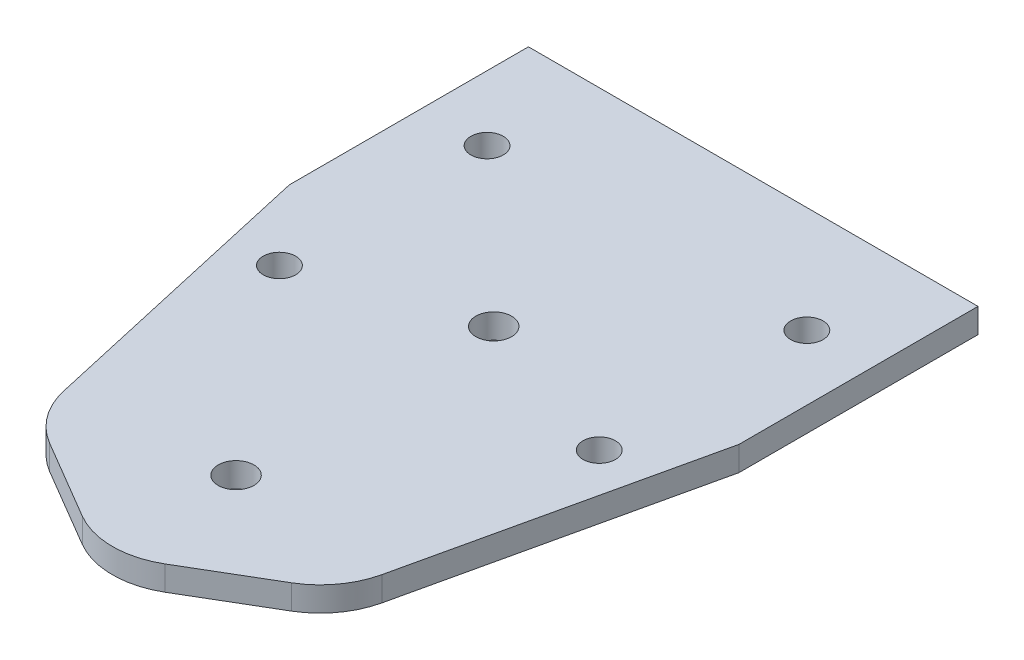
ISO-10303-21;
HEADER;
FILE_DESCRIPTION(('STEP AP214'),'2;1');
FILE_NAME('part.step','',(''),(''),'','','');
FILE_SCHEMA(('AUTOMOTIVE_DESIGN { 1 0 10303 214 1 1 1 1 }'));
ENDSEC;
DATA;
#1=APPLICATION_CONTEXT('core data for automotive mechanical design processes');
#2=APPLICATION_PROTOCOL_DEFINITION('international standard','automotive_design',2000,#1);
#3=PRODUCT_CONTEXT('',#1,'mechanical');
#4=PRODUCT('Part','Part','',(#3));
#5=PRODUCT_RELATED_PRODUCT_CATEGORY('part','',(#4));
#6=PRODUCT_DEFINITION_FORMATION('','',#4);
#7=PRODUCT_DEFINITION_CONTEXT('part definition',#1,'design');
#8=PRODUCT_DEFINITION('design','',#6,#7);
#9=PRODUCT_DEFINITION_SHAPE('','',#8);
#10=(LENGTH_UNIT() NAMED_UNIT(*) SI_UNIT(.MILLI.,.METRE.));
#11=(NAMED_UNIT(*) PLANE_ANGLE_UNIT() SI_UNIT($,.RADIAN.));
#12=(NAMED_UNIT(*) SI_UNIT($,.STERADIAN.) SOLID_ANGLE_UNIT());
#13=UNCERTAINTY_MEASURE_WITH_UNIT(LENGTH_MEASURE(1.E-05),#10,'distance_accuracy_value','');
#14=(GEOMETRIC_REPRESENTATION_CONTEXT(3) GLOBAL_UNCERTAINTY_ASSIGNED_CONTEXT((#13)) GLOBAL_UNIT_ASSIGNED_CONTEXT((#10,
#11,#12)) REPRESENTATION_CONTEXT('',''));
#15=CARTESIAN_POINT('',(0.,0.,0.));
#16=DIRECTION('',(0.,0.,1.));
#17=DIRECTION('',(1.,0.,0.));
#18=AXIS2_PLACEMENT_3D('',#15,#16,#17);
#19=CARTESIAN_POINT('',(-27.5,3.,40.));
#20=DIRECTION('',(1.,0.,0.));
#21=DIRECTION('',(0.,0.,-1.));
#22=AXIS2_PLACEMENT_3D('',#19,#20,#21);
#23=PLANE('',#22);
#24=DIRECTION('',(0.,1.,0.));
#25=VECTOR('',#24,1.);
#26=CARTESIAN_POINT('',(-27.5,0.,-10.7528728164823));
#27=LINE('',#26,#25);
#28=CARTESIAN_POINT('',(-27.5,0.,-10.7528728164823));
#29=VERTEX_POINT('',#28);
#30=CARTESIAN_POINT('',(-27.5,3.,-10.7528728164823));
#31=VERTEX_POINT('',#30);
#32=EDGE_CURVE('E111',#29,#31,#27,.T.);
#33=ORIENTED_EDGE('',*,*,#32,.T.);
#34=DIRECTION('',(0.,0.,1.));
#35=VECTOR('',#34,1.);
#36=CARTESIAN_POINT('',(-27.5,3.,40.));
#37=LINE('',#36,#35);
#38=CARTESIAN_POINT('',(-27.5,3.,-40.));
#39=VERTEX_POINT('',#38);
#40=EDGE_CURVE('E145',#39,#31,#37,.T.);
#41=ORIENTED_EDGE('',*,*,#40,.F.);
#42=DIRECTION('',(0.,-1.,0.));
#43=VECTOR('',#42,1.);
#44=CARTESIAN_POINT('',(-27.5,3.,-40.));
#45=LINE('',#44,#43);
#46=CARTESIAN_POINT('',(-27.5,0.,-40.));
#47=VERTEX_POINT('',#46);
#48=EDGE_CURVE('E133',#39,#47,#45,.T.);
#49=ORIENTED_EDGE('',*,*,#48,.T.);
#50=DIRECTION('',(0.,0.,1.));
#51=VECTOR('',#50,1.);
#52=CARTESIAN_POINT('',(-27.5,0.,40.));
#53=LINE('',#52,#51);
#54=EDGE_CURVE('E128',#47,#29,#53,.T.);
#55=ORIENTED_EDGE('',*,*,#54,.T.);
#56=EDGE_LOOP('',(#33,#41,#49,#55));
#57=FACE_BOUND('',#56,.T.);
#58=ADVANCED_FACE('F33',(#57),#23,.F.);
#59=CARTESIAN_POINT('',(0.,3.,0.));
#60=DIRECTION('',(0.,-1.,0.));
#61=DIRECTION('',(0.,0.,-1.));
#62=AXIS2_PLACEMENT_3D('',#59,#60,#61);
#63=PLANE('',#62);
#64=CARTESIAN_POINT('',(0.,3.,-8.24999999999999));
#65=DIRECTION('',(0.,1.,0.));
#66=DIRECTION('',(0.,0.,1.));
#67=AXIS2_PLACEMENT_3D('',#64,#65,#66);
#68=CIRCLE('',#67,2.185);
#69=CARTESIAN_POINT('',(0.,3.,-6.065));
#70=VERTEX_POINT('',#69);
#71=EDGE_CURVE('E220',#70,#70,#68,.T.);
#72=ORIENTED_EDGE('',*,*,#71,.F.);
#73=EDGE_LOOP('',(#72));
#74=FACE_BOUND('',#73,.T.);
#75=CARTESIAN_POINT('',(0.,3.,23.271));
#76=DIRECTION('',(0.,1.,0.));
#77=DIRECTION('',(0.,0.,1.));
#78=AXIS2_PLACEMENT_3D('',#75,#76,#77);
#79=CIRCLE('',#78,2.185);
#80=CARTESIAN_POINT('',(0.,3.,25.456));
#81=VERTEX_POINT('',#80);
#82=EDGE_CURVE('E214',#81,#81,#79,.T.);
#83=ORIENTED_EDGE('',*,*,#82,.F.);
#84=EDGE_LOOP('',(#83));
#85=FACE_BOUND('',#84,.T.);
#86=CARTESIAN_POINT('',(-19.5625,3.,-27.));
#87=DIRECTION('',(0.,1.,0.));
#88=DIRECTION('',(0.,0.,1.));
#89=AXIS2_PLACEMENT_3D('',#86,#87,#88);
#90=CIRCLE('',#89,1.98437499999999);
#91=CARTESIAN_POINT('',(-19.5625,3.,-25.015625));
#92=VERTEX_POINT('',#91);
#93=EDGE_CURVE('E208',#92,#92,#90,.T.);
#94=ORIENTED_EDGE('',*,*,#93,.F.);
#95=EDGE_LOOP('',(#94));
#96=FACE_BOUND('',#95,.T.);
#97=CARTESIAN_POINT('',(-19.5625,3.,-1.59999999999999));
#98=DIRECTION('',(0.,1.,0.));
#99=DIRECTION('',(0.,0.,1.));
#100=AXIS2_PLACEMENT_3D('',#97,#98,#99);
#101=CIRCLE('',#100,1.984375);
#102=CARTESIAN_POINT('',(-19.5625,3.,0.384375000000001));
#103=VERTEX_POINT('',#102);
#104=EDGE_CURVE('E202',#103,#103,#101,.T.);
#105=ORIENTED_EDGE('',*,*,#104,.F.);
#106=EDGE_LOOP('',(#105));
#107=FACE_BOUND('',#106,.T.);
#108=CARTESIAN_POINT('',(19.5625,3.,-27.));
#109=DIRECTION('',(0.,1.,0.));
#110=DIRECTION('',(0.,0.,-1.));
#111=AXIS2_PLACEMENT_3D('',#108,#109,#110);
#112=CIRCLE('',#111,1.98437499999999);
#113=CARTESIAN_POINT('',(19.5625,3.,-28.984375));
#114=VERTEX_POINT('',#113);
#115=EDGE_CURVE('E196',#114,#114,#112,.T.);
#116=ORIENTED_EDGE('',*,*,#115,.F.);
#117=EDGE_LOOP('',(#116));
#118=FACE_BOUND('',#117,.T.);
#119=CARTESIAN_POINT('',(19.5625,3.,-1.6));
#120=DIRECTION('',(0.,1.,0.));
#121=DIRECTION('',(0.,0.,-1.));
#122=AXIS2_PLACEMENT_3D('',#119,#120,#121);
#123=CIRCLE('',#122,1.984375);
#124=CARTESIAN_POINT('',(19.5625,3.,-3.58437499999999));
#125=VERTEX_POINT('',#124);
#126=EDGE_CURVE('E192',#125,#125,#123,.T.);
#127=ORIENTED_EDGE('',*,*,#126,.F.);
#128=EDGE_LOOP('',(#127));
#129=FACE_BOUND('',#128,.T.);
#130=DIRECTION('',(-0.861586438812453,0.,0.507610882915719));
#131=VECTOR('',#130,1.);
#132=CARTESIAN_POINT('',(17.494026116552,3.,29.693247661821));
#133=LINE('',#132,#131);
#134=CARTESIAN_POINT('',(14.7835063829739,3.,31.2901731160081));
#135=VERTEX_POINT('',#134);
#136=CARTESIAN_POINT('',(5.07610882915718,3.,37.0093678724838));
#137=VERTEX_POINT('',#136);
#138=EDGE_CURVE('E185',#135,#137,#133,.T.);
#139=ORIENTED_EDGE('',*,*,#138,.F.);
#140=CARTESIAN_POINT('',(9.7073975538167,3.,22.6743087278836));
#141=DIRECTION('',(0.,-1.,0.));
#142=DIRECTION('',(0.,0.,-1.));
#143=AXIS2_PLACEMENT_3D('',#140,#141,#142);
#144=CIRCLE('',#143,10.);
#145=CARTESIAN_POINT('',(19.4622335199498,3.,24.875030262707));
#146=VERTEX_POINT('',#145);
#147=EDGE_CURVE('E157',#135,#146,#144,.F.);
#148=ORIENTED_EDGE('',*,*,#147,.T.);
#149=DIRECTION('',(-0.22007215348234,0.,0.975483596613314));
#150=VECTOR('',#149,1.);
#151=CARTESIAN_POINT('',(23.8597347329364,3.,5.38283085684337));
#152=LINE('',#151,#150);
#153=CARTESIAN_POINT('',(27.5,3.,-10.7528728164823));
#154=VERTEX_POINT('',#153);
#155=EDGE_CURVE('E121',#154,#146,#152,.T.);
#156=ORIENTED_EDGE('',*,*,#155,.F.);
#157=DIRECTION('',(0.,0.,-1.));
#158=VECTOR('',#157,1.);
#159=CARTESIAN_POINT('',(27.5,3.,40.));
#160=LINE('',#159,#158);
#161=CARTESIAN_POINT('',(27.5,3.,-40.));
#162=VERTEX_POINT('',#161);
#163=EDGE_CURVE('E134',#154,#162,#160,.T.);
#164=ORIENTED_EDGE('',*,*,#163,.T.);
#165=DIRECTION('',(-1.,0.,0.));
#166=VECTOR('',#165,1.);
#167=CARTESIAN_POINT('',(-27.5,3.,-40.));
#168=LINE('',#167,#166);
#169=EDGE_CURVE('E137',#162,#39,#168,.T.);
#170=ORIENTED_EDGE('',*,*,#169,.T.);
#171=ORIENTED_EDGE('',*,*,#40,.T.);
#172=DIRECTION('',(0.22007215348234,0.,0.975483596613314));
#173=VECTOR('',#172,1.);
#174=CARTESIAN_POINT('',(-23.8597347329364,3.,5.38283085684337));
#175=LINE('',#174,#173);
#176=CARTESIAN_POINT('',(-19.4622335199498,3.,24.875030262707));
#177=VERTEX_POINT('',#176);
#178=EDGE_CURVE('E116',#31,#177,#175,.T.);
#179=ORIENTED_EDGE('',*,*,#178,.T.);
#180=CARTESIAN_POINT('',(-9.7073975538167,3.,22.6743087278836));
#181=DIRECTION('',(0.,-1.,0.));
#182=DIRECTION('',(0.,0.,-1.));
#183=AXIS2_PLACEMENT_3D('',#180,#181,#182);
#184=CIRCLE('',#183,10.);
#185=CARTESIAN_POINT('',(-14.7835063829739,3.,31.2901731160081));
#186=VERTEX_POINT('',#185);
#187=EDGE_CURVE('E153',#177,#186,#184,.F.);
#188=ORIENTED_EDGE('',*,*,#187,.T.);
#189=DIRECTION('',(0.861586438812453,0.,0.507610882915719));
#190=VECTOR('',#189,1.);
#191=CARTESIAN_POINT('',(-17.494026116552,3.,29.693247661821));
#192=LINE('',#191,#190);
#193=CARTESIAN_POINT('',(-5.07610882915718,3.,37.0093678724838));
#194=VERTEX_POINT('',#193);
#195=EDGE_CURVE('E129',#186,#194,#192,.T.);
#196=ORIENTED_EDGE('',*,*,#195,.T.);
#197=CARTESIAN_POINT('',(0.,3.,28.3935034843593));
#198=DIRECTION('',(0.,-1.,0.));
#199=DIRECTION('',(0.,0.,-1.));
#200=AXIS2_PLACEMENT_3D('',#197,#198,#199);
#201=CIRCLE('',#200,10.);
#202=EDGE_CURVE('E155',#194,#137,#201,.F.);
#203=ORIENTED_EDGE('',*,*,#202,.T.);
#204=EDGE_LOOP('',(#139,#148,#156,#164,#170,#171,#179,#188,#196,#203));
#205=FACE_BOUND('',#204,.T.);
#206=ADVANCED_FACE('F176',(#74,#85,#96,#107,#118,#129,#205),#63,.F.);
#207=CARTESIAN_POINT('',(0.,0.,0.));
#208=DIRECTION('',(0.,-1.,0.));
#209=DIRECTION('',(0.,0.,-1.));
#210=AXIS2_PLACEMENT_3D('',#207,#208,#209);
#211=PLANE('',#210);
#212=CARTESIAN_POINT('',(19.5625,0.,-1.6));
#213=DIRECTION('',(0.,1.,0.));
#214=DIRECTION('',(0.,0.,-1.));
#215=AXIS2_PLACEMENT_3D('',#212,#213,#214);
#216=CIRCLE('',#215,1.984375);
#217=CARTESIAN_POINT('',(19.5625,0.,-3.58437499999999));
#218=VERTEX_POINT('',#217);
#219=EDGE_CURVE('E193',#218,#218,#216,.T.);
#220=ORIENTED_EDGE('',*,*,#219,.T.);
#221=EDGE_LOOP('',(#220));
#222=FACE_BOUND('',#221,.T.);
#223=CARTESIAN_POINT('',(19.5625,0.,-27.));
#224=DIRECTION('',(0.,1.,0.));
#225=DIRECTION('',(0.,0.,-1.));
#226=AXIS2_PLACEMENT_3D('',#223,#224,#225);
#227=CIRCLE('',#226,1.98437499999999);
#228=CARTESIAN_POINT('',(19.5625,0.,-28.984375));
#229=VERTEX_POINT('',#228);
#230=EDGE_CURVE('E199',#229,#229,#227,.T.);
#231=ORIENTED_EDGE('',*,*,#230,.T.);
#232=EDGE_LOOP('',(#231));
#233=FACE_BOUND('',#232,.T.);
#234=CARTESIAN_POINT('',(-19.5625,0.,-1.59999999999999));
#235=DIRECTION('',(0.,1.,0.));
#236=DIRECTION('',(0.,0.,1.));
#237=AXIS2_PLACEMENT_3D('',#234,#235,#236);
#238=CIRCLE('',#237,1.984375);
#239=CARTESIAN_POINT('',(-19.5625,0.,0.384375000000001));
#240=VERTEX_POINT('',#239);
#241=EDGE_CURVE('E205',#240,#240,#238,.T.);
#242=ORIENTED_EDGE('',*,*,#241,.T.);
#243=EDGE_LOOP('',(#242));
#244=FACE_BOUND('',#243,.T.);
#245=CARTESIAN_POINT('',(-19.5625,0.,-27.));
#246=DIRECTION('',(0.,1.,0.));
#247=DIRECTION('',(0.,0.,1.));
#248=AXIS2_PLACEMENT_3D('',#245,#246,#247);
#249=CIRCLE('',#248,1.98437499999999);
#250=CARTESIAN_POINT('',(-19.5625,0.,-25.015625));
#251=VERTEX_POINT('',#250);
#252=EDGE_CURVE('E211',#251,#251,#249,.T.);
#253=ORIENTED_EDGE('',*,*,#252,.T.);
#254=EDGE_LOOP('',(#253));
#255=FACE_BOUND('',#254,.T.);
#256=CARTESIAN_POINT('',(0.,0.,23.271));
#257=DIRECTION('',(0.,1.,0.));
#258=DIRECTION('',(0.,0.,1.));
#259=AXIS2_PLACEMENT_3D('',#256,#257,#258);
#260=CIRCLE('',#259,2.185);
#261=CARTESIAN_POINT('',(0.,0.,25.456));
#262=VERTEX_POINT('',#261);
#263=EDGE_CURVE('E217',#262,#262,#260,.T.);
#264=ORIENTED_EDGE('',*,*,#263,.T.);
#265=EDGE_LOOP('',(#264));
#266=FACE_BOUND('',#265,.T.);
#267=CARTESIAN_POINT('',(0.,0.,-8.24999999999999));
#268=DIRECTION('',(0.,1.,0.));
#269=DIRECTION('',(0.,0.,1.));
#270=AXIS2_PLACEMENT_3D('',#267,#268,#269);
#271=CIRCLE('',#270,2.185);
#272=CARTESIAN_POINT('',(0.,0.,-6.065));
#273=VERTEX_POINT('',#272);
#274=EDGE_CURVE('E223',#273,#273,#271,.T.);
#275=ORIENTED_EDGE('',*,*,#274,.T.);
#276=EDGE_LOOP('',(#275));
#277=FACE_BOUND('',#276,.T.);
#278=DIRECTION('',(-0.22007215348234,0.,0.975483596613314));
#279=VECTOR('',#278,1.);
#280=CARTESIAN_POINT('',(23.8597347329364,0.,5.38283085684337));
#281=LINE('',#280,#279);
#282=CARTESIAN_POINT('',(27.5,0.,-10.7528728164823));
#283=VERTEX_POINT('',#282);
#284=CARTESIAN_POINT('',(19.4622335199498,0.,24.875030262707));
#285=VERTEX_POINT('',#284);
#286=EDGE_CURVE('E182',#283,#285,#281,.T.);
#287=ORIENTED_EDGE('',*,*,#286,.T.);
#288=CARTESIAN_POINT('',(9.7073975538167,0.,22.6743087278836));
#289=DIRECTION('',(0.,-1.,0.));
#290=DIRECTION('',(0.,0.,-1.));
#291=AXIS2_PLACEMENT_3D('',#288,#289,#290);
#292=CIRCLE('',#291,10.);
#293=CARTESIAN_POINT('',(14.7835063829739,0.,31.2901731160081));
#294=VERTEX_POINT('',#293);
#295=EDGE_CURVE('E163',#285,#294,#292,.T.);
#296=ORIENTED_EDGE('',*,*,#295,.T.);
#297=DIRECTION('',(-0.861586438812453,0.,0.507610882915719));
#298=VECTOR('',#297,1.);
#299=CARTESIAN_POINT('',(17.494026116552,0.,29.693247661821));
#300=LINE('',#299,#298);
#301=CARTESIAN_POINT('',(5.07610882915718,0.,37.0093678724838));
#302=VERTEX_POINT('',#301);
#303=EDGE_CURVE('E184',#294,#302,#300,.T.);
#304=ORIENTED_EDGE('',*,*,#303,.T.);
#305=CARTESIAN_POINT('',(0.,0.,28.3935034843593));
#306=DIRECTION('',(0.,-1.,0.));
#307=DIRECTION('',(0.,0.,-1.));
#308=AXIS2_PLACEMENT_3D('',#305,#306,#307);
#309=CIRCLE('',#308,10.);
#310=CARTESIAN_POINT('',(-5.07610882915718,0.,37.0093678724838));
#311=VERTEX_POINT('',#310);
#312=EDGE_CURVE('E54',#302,#311,#309,.T.);
#313=ORIENTED_EDGE('',*,*,#312,.T.);
#314=DIRECTION('',(0.861586438812453,0.,0.507610882915719));
#315=VECTOR('',#314,1.);
#316=CARTESIAN_POINT('',(-17.494026116552,0.,29.693247661821));
#317=LINE('',#316,#315);
#318=CARTESIAN_POINT('',(-14.7835063829739,0.,31.2901731160081));
#319=VERTEX_POINT('',#318);
#320=EDGE_CURVE('E122',#319,#311,#317,.T.);
#321=ORIENTED_EDGE('',*,*,#320,.F.);
#322=CARTESIAN_POINT('',(-9.7073975538167,0.,22.6743087278836));
#323=DIRECTION('',(0.,-1.,0.));
#324=DIRECTION('',(0.,0.,-1.));
#325=AXIS2_PLACEMENT_3D('',#322,#323,#324);
#326=CIRCLE('',#325,10.);
#327=CARTESIAN_POINT('',(-19.4622335199498,0.,24.875030262707));
#328=VERTEX_POINT('',#327);
#329=EDGE_CURVE('E48',#319,#328,#326,.T.);
#330=ORIENTED_EDGE('',*,*,#329,.T.);
#331=DIRECTION('',(0.22007215348234,0.,0.975483596613314));
#332=VECTOR('',#331,1.);
#333=CARTESIAN_POINT('',(-23.8597347329364,0.,5.38283085684337));
#334=LINE('',#333,#332);
#335=EDGE_CURVE('E113',#29,#328,#334,.T.);
#336=ORIENTED_EDGE('',*,*,#335,.F.);
#337=ORIENTED_EDGE('',*,*,#54,.F.);
#338=DIRECTION('',(-1.,0.,0.));
#339=VECTOR('',#338,1.);
#340=CARTESIAN_POINT('',(-27.5,0.,-40.));
#341=LINE('',#340,#339);
#342=CARTESIAN_POINT('',(27.5,0.,-40.));
#343=VERTEX_POINT('',#342);
#344=EDGE_CURVE('E135',#343,#47,#341,.T.);
#345=ORIENTED_EDGE('',*,*,#344,.F.);
#346=DIRECTION('',(0.,0.,-1.));
#347=VECTOR('',#346,1.);
#348=CARTESIAN_POINT('',(27.5,0.,40.));
#349=LINE('',#348,#347);
#350=EDGE_CURVE('E139',#283,#343,#349,.T.);
#351=ORIENTED_EDGE('',*,*,#350,.F.);
#352=EDGE_LOOP('',(#287,#296,#304,#313,#321,#330,#336,#337,#345,#351));
#353=FACE_BOUND('',#352,.T.);
#354=ADVANCED_FACE('F126',(#222,#233,#244,#255,#266,#277,#353),#211,.T.);
#355=CARTESIAN_POINT('',(27.5,3.,40.));
#356=DIRECTION('',(-1.,0.,0.));
#357=DIRECTION('',(0.,0.,1.));
#358=AXIS2_PLACEMENT_3D('',#355,#356,#357);
#359=PLANE('',#358);
#360=ORIENTED_EDGE('',*,*,#163,.F.);
#361=DIRECTION('',(0.,1.,0.));
#362=VECTOR('',#361,1.);
#363=CARTESIAN_POINT('',(27.5,0.,-10.7528728164823));
#364=LINE('',#363,#362);
#365=EDGE_CURVE('E187',#283,#154,#364,.T.);
#366=ORIENTED_EDGE('',*,*,#365,.F.);
#367=ORIENTED_EDGE('',*,*,#350,.T.);
#368=DIRECTION('',(0.,-1.,0.));
#369=VECTOR('',#368,1.);
#370=CARTESIAN_POINT('',(27.5,3.,-40.));
#371=LINE('',#370,#369);
#372=EDGE_CURVE('E144',#162,#343,#371,.T.);
#373=ORIENTED_EDGE('',*,*,#372,.F.);
#374=EDGE_LOOP('',(#360,#366,#367,#373));
#375=FACE_BOUND('',#374,.T.);
#376=ADVANCED_FACE('F234',(#375),#359,.F.);
#377=CARTESIAN_POINT('',(-27.5,3.,-40.));
#378=DIRECTION('',(0.,0.,1.));
#379=DIRECTION('',(1.,0.,0.));
#380=AXIS2_PLACEMENT_3D('',#377,#378,#379);
#381=PLANE('',#380);
#382=ORIENTED_EDGE('',*,*,#344,.T.);
#383=ORIENTED_EDGE('',*,*,#48,.F.);
#384=ORIENTED_EDGE('',*,*,#169,.F.);
#385=ORIENTED_EDGE('',*,*,#372,.T.);
#386=EDGE_LOOP('',(#382,#383,#384,#385));
#387=FACE_BOUND('',#386,.T.);
#388=ADVANCED_FACE('F237',(#387),#381,.F.);
#389=CARTESIAN_POINT('',(0.,0.,-8.24999999999999));
#390=DIRECTION('',(0.,1.,0.));
#391=DIRECTION('',(0.,0.,1.));
#392=AXIS2_PLACEMENT_3D('',#389,#390,#391);
#393=CYLINDRICAL_SURFACE('',#392,2.185);
#394=ORIENTED_EDGE('',*,*,#274,.F.);
#395=EDGE_LOOP('',(#394));
#396=FACE_BOUND('',#395,.T.);
#397=ORIENTED_EDGE('',*,*,#71,.T.);
#398=EDGE_LOOP('',(#397));
#399=FACE_BOUND('',#398,.T.);
#400=ADVANCED_FACE('F269',(#396,#399),#393,.F.);
#401=CARTESIAN_POINT('',(0.,0.,23.271));
#402=DIRECTION('',(0.,1.,0.));
#403=DIRECTION('',(0.,0.,1.));
#404=AXIS2_PLACEMENT_3D('',#401,#402,#403);
#405=CYLINDRICAL_SURFACE('',#404,2.185);
#406=ORIENTED_EDGE('',*,*,#263,.F.);
#407=EDGE_LOOP('',(#406));
#408=FACE_BOUND('',#407,.T.);
#409=ORIENTED_EDGE('',*,*,#82,.T.);
#410=EDGE_LOOP('',(#409));
#411=FACE_BOUND('',#410,.T.);
#412=ADVANCED_FACE('F291',(#408,#411),#405,.F.);
#413=CARTESIAN_POINT('',(-19.5625,0.,-27.));
#414=DIRECTION('',(0.,1.,0.));
#415=DIRECTION('',(0.,0.,1.));
#416=AXIS2_PLACEMENT_3D('',#413,#414,#415);
#417=CYLINDRICAL_SURFACE('',#416,1.98437499999999);
#418=ORIENTED_EDGE('',*,*,#252,.F.);
#419=EDGE_LOOP('',(#418));
#420=FACE_BOUND('',#419,.T.);
#421=ORIENTED_EDGE('',*,*,#93,.T.);
#422=EDGE_LOOP('',(#421));
#423=FACE_BOUND('',#422,.T.);
#424=ADVANCED_FACE('F322',(#420,#423),#417,.F.);
#425=CARTESIAN_POINT('',(-19.5625,0.,-1.59999999999999));
#426=DIRECTION('',(0.,1.,0.));
#427=DIRECTION('',(0.,0.,1.));
#428=AXIS2_PLACEMENT_3D('',#425,#426,#427);
#429=CYLINDRICAL_SURFACE('',#428,1.984375);
#430=ORIENTED_EDGE('',*,*,#241,.F.);
#431=EDGE_LOOP('',(#430));
#432=FACE_BOUND('',#431,.T.);
#433=ORIENTED_EDGE('',*,*,#104,.T.);
#434=EDGE_LOOP('',(#433));
#435=FACE_BOUND('',#434,.T.);
#436=ADVANCED_FACE('F315',(#432,#435),#429,.F.);
#437=CARTESIAN_POINT('',(19.5625,0.,-27.));
#438=DIRECTION('',(0.,1.,0.));
#439=DIRECTION('',(0.,0.,1.));
#440=AXIS2_PLACEMENT_3D('',#437,#438,#439);
#441=CYLINDRICAL_SURFACE('',#440,1.98437499999999);
#442=ORIENTED_EDGE('',*,*,#230,.F.);
#443=EDGE_LOOP('',(#442));
#444=FACE_BOUND('',#443,.T.);
#445=ORIENTED_EDGE('',*,*,#115,.T.);
#446=EDGE_LOOP('',(#445));
#447=FACE_BOUND('',#446,.T.);
#448=ADVANCED_FACE('F307',(#444,#447),#441,.F.);
#449=CARTESIAN_POINT('',(19.5625,0.,-1.6));
#450=DIRECTION('',(0.,1.,0.));
#451=DIRECTION('',(0.,0.,1.));
#452=AXIS2_PLACEMENT_3D('',#449,#450,#451);
#453=CYLINDRICAL_SURFACE('',#452,1.984375);
#454=ORIENTED_EDGE('',*,*,#219,.F.);
#455=EDGE_LOOP('',(#454));
#456=FACE_BOUND('',#455,.T.);
#457=ORIENTED_EDGE('',*,*,#126,.T.);
#458=EDGE_LOOP('',(#457));
#459=FACE_BOUND('',#458,.T.);
#460=ADVANCED_FACE('F305',(#456,#459),#453,.F.);
#461=CARTESIAN_POINT('',(23.8597347329364,0.,5.38283085684337));
#462=DIRECTION('',(-0.975483596613314,0.,-0.220072153482339));
#463=DIRECTION('',(-0.220072153482339,0.,0.975483596613314));
#464=AXIS2_PLACEMENT_3D('',#461,#462,#463);
#465=PLANE('',#464);
#466=ORIENTED_EDGE('',*,*,#155,.T.);
#467=DIRECTION('',(0.,1.,0.));
#468=VECTOR('',#467,1.);
#469=CARTESIAN_POINT('',(19.4622335199498,0.,24.875030262707));
#470=LINE('',#469,#468);
#471=EDGE_CURVE('E159',#146,#285,#470,.F.);
#472=ORIENTED_EDGE('',*,*,#471,.T.);
#473=ORIENTED_EDGE('',*,*,#286,.F.);
#474=ORIENTED_EDGE('',*,*,#365,.T.);
#475=EDGE_LOOP('',(#466,#472,#473,#474));
#476=FACE_BOUND('',#475,.T.);
#477=ADVANCED_FACE('F241',(#476),#465,.F.);
#478=CARTESIAN_POINT('',(17.494026116552,0.,29.693247661821));
#479=DIRECTION('',(-0.507610882915718,0.,-0.861586438812453));
#480=DIRECTION('',(-0.861586438812453,0.,0.507610882915719));
#481=AXIS2_PLACEMENT_3D('',#478,#479,#480);
#482=PLANE('',#481);
#483=ORIENTED_EDGE('',*,*,#303,.F.);
#484=DIRECTION('',(0.,1.,0.));
#485=VECTOR('',#484,1.);
#486=CARTESIAN_POINT('',(14.7835063829739,0.,31.2901731160081));
#487=LINE('',#486,#485);
#488=EDGE_CURVE('E150',#294,#135,#487,.T.);
#489=ORIENTED_EDGE('',*,*,#488,.T.);
#490=ORIENTED_EDGE('',*,*,#138,.T.);
#491=DIRECTION('',(0.,1.,0.));
#492=VECTOR('',#491,1.);
#493=CARTESIAN_POINT('',(5.07610882915719,0.,37.0093678724838));
#494=LINE('',#493,#492);
#495=EDGE_CURVE('E148',#137,#302,#494,.F.);
#496=ORIENTED_EDGE('',*,*,#495,.T.);
#497=EDGE_LOOP('',(#483,#489,#490,#496));
#498=FACE_BOUND('',#497,.T.);
#499=ADVANCED_FACE('F248',(#498),#482,.F.);
#500=CARTESIAN_POINT('',(-23.8597347329364,0.,5.38283085684337));
#501=DIRECTION('',(-0.975483596613314,0.,0.220072153482339));
#502=DIRECTION('',(0.220072153482339,0.,0.975483596613314));
#503=AXIS2_PLACEMENT_3D('',#500,#501,#502);
#504=PLANE('',#503);
#505=ORIENTED_EDGE('',*,*,#335,.T.);
#506=DIRECTION('',(0.,1.,0.));
#507=VECTOR('',#506,1.);
#508=CARTESIAN_POINT('',(-19.4622335199498,0.,24.875030262707));
#509=LINE('',#508,#507);
#510=EDGE_CURVE('E11',#328,#177,#509,.T.);
#511=ORIENTED_EDGE('',*,*,#510,.T.);
#512=ORIENTED_EDGE('',*,*,#178,.F.);
#513=ORIENTED_EDGE('',*,*,#32,.F.);
#514=EDGE_LOOP('',(#505,#511,#512,#513));
#515=FACE_BOUND('',#514,.T.);
#516=ADVANCED_FACE('F112',(#515),#504,.T.);
#517=CARTESIAN_POINT('',(-17.494026116552,0.,29.693247661821));
#518=DIRECTION('',(-0.507610882915718,0.,0.861586438812453));
#519=DIRECTION('',(0.861586438812453,0.,0.507610882915719));
#520=AXIS2_PLACEMENT_3D('',#517,#518,#519);
#521=PLANE('',#520);
#522=ORIENTED_EDGE('',*,*,#320,.T.);
#523=DIRECTION('',(0.,1.,0.));
#524=VECTOR('',#523,1.);
#525=CARTESIAN_POINT('',(-5.07610882915719,3.,37.0093678724838));
#526=LINE('',#525,#524);
#527=EDGE_CURVE('E41',#311,#194,#526,.T.);
#528=ORIENTED_EDGE('',*,*,#527,.T.);
#529=ORIENTED_EDGE('',*,*,#195,.F.);
#530=DIRECTION('',(0.,1.,0.));
#531=VECTOR('',#530,1.);
#532=CARTESIAN_POINT('',(-14.7835063829739,0.,31.2901731160081));
#533=LINE('',#532,#531);
#534=EDGE_CURVE('E165',#186,#319,#533,.F.);
#535=ORIENTED_EDGE('',*,*,#534,.T.);
#536=EDGE_LOOP('',(#522,#528,#529,#535));
#537=FACE_BOUND('',#536,.T.);
#538=ADVANCED_FACE('F171',(#537),#521,.T.);
#539=CARTESIAN_POINT('',(9.7073975538167,0.,22.6743087278836));
#540=DIRECTION('',(0.,1.,0.));
#541=DIRECTION('',(0.,0.,1.));
#542=AXIS2_PLACEMENT_3D('',#539,#540,#541);
#543=CYLINDRICAL_SURFACE('',#542,10.);
#544=ORIENTED_EDGE('',*,*,#295,.F.);
#545=ORIENTED_EDGE('',*,*,#471,.F.);
#546=ORIENTED_EDGE('',*,*,#147,.F.);
#547=ORIENTED_EDGE('',*,*,#488,.F.);
#548=EDGE_LOOP('',(#544,#545,#546,#547));
#549=FACE_BOUND('',#548,.T.);
#550=ADVANCED_FACE('F244',(#549),#543,.T.);
#551=CARTESIAN_POINT('',(0.,0.,28.3935034843593));
#552=DIRECTION('',(0.,-1.,0.));
#553=DIRECTION('',(0.,0.,-1.));
#554=AXIS2_PLACEMENT_3D('',#551,#552,#553);
#555=CYLINDRICAL_SURFACE('',#554,10.);
#556=ORIENTED_EDGE('',*,*,#312,.F.);
#557=ORIENTED_EDGE('',*,*,#495,.F.);
#558=ORIENTED_EDGE('',*,*,#202,.F.);
#559=ORIENTED_EDGE('',*,*,#527,.F.);
#560=EDGE_LOOP('',(#556,#557,#558,#559));
#561=FACE_BOUND('',#560,.T.);
#562=ADVANCED_FACE('F250',(#561),#555,.T.);
#563=CARTESIAN_POINT('',(-9.7073975538167,0.,22.6743087278836));
#564=DIRECTION('',(0.,1.,0.));
#565=DIRECTION('',(0.,0.,1.));
#566=AXIS2_PLACEMENT_3D('',#563,#564,#565);
#567=CYLINDRICAL_SURFACE('',#566,10.);
#568=ORIENTED_EDGE('',*,*,#329,.F.);
#569=ORIENTED_EDGE('',*,*,#534,.F.);
#570=ORIENTED_EDGE('',*,*,#187,.F.);
#571=ORIENTED_EDGE('',*,*,#510,.F.);
#572=EDGE_LOOP('',(#568,#569,#570,#571));
#573=FACE_BOUND('',#572,.T.);
#574=ADVANCED_FACE('F35',(#573),#567,.T.);
#575=CLOSED_SHELL('',(#58,#206,#354,#376,#388,#400,#412,#424,#436,#448,#460,#477,#499,#516,#538,
#550,#562,#574));
#576=MANIFOLD_SOLID_BREP('B2',#575);
#577=ADVANCED_BREP_SHAPE_REPRESENTATION('',(#18,#576),#14);
#578=SHAPE_DEFINITION_REPRESENTATION(#9,#577);
ENDSEC;
END-ISO-10303-21;
